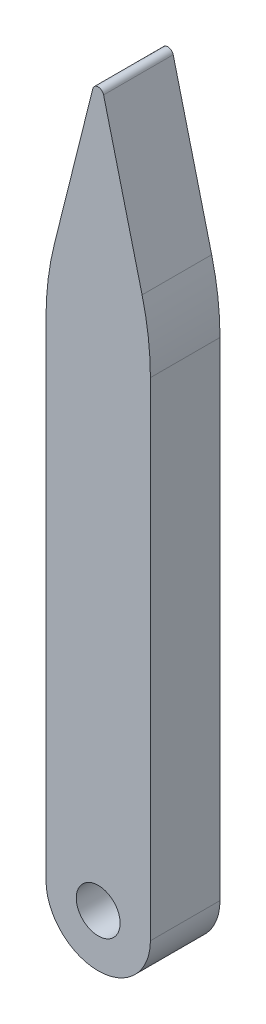
ISO-10303-21;
HEADER;
FILE_DESCRIPTION(('STEP AP214'),'2;1');
FILE_NAME('part.step','',(''),(''),'','','');
FILE_SCHEMA(('AUTOMOTIVE_DESIGN { 1 0 10303 214 1 1 1 1 }'));
ENDSEC;
DATA;
#1=APPLICATION_CONTEXT('core data for automotive mechanical design processes');
#2=APPLICATION_PROTOCOL_DEFINITION('international standard','automotive_design',2000,#1);
#3=PRODUCT_CONTEXT('',#1,'mechanical');
#4=PRODUCT('Part','Part','',(#3));
#5=PRODUCT_RELATED_PRODUCT_CATEGORY('part','',(#4));
#6=PRODUCT_DEFINITION_FORMATION('','',#4);
#7=PRODUCT_DEFINITION_CONTEXT('part definition',#1,'design');
#8=PRODUCT_DEFINITION('design','',#6,#7);
#9=PRODUCT_DEFINITION_SHAPE('','',#8);
#10=(LENGTH_UNIT() NAMED_UNIT(*) SI_UNIT(.MILLI.,.METRE.));
#11=(NAMED_UNIT(*) PLANE_ANGLE_UNIT() SI_UNIT($,.RADIAN.));
#12=(NAMED_UNIT(*) SI_UNIT($,.STERADIAN.) SOLID_ANGLE_UNIT());
#13=UNCERTAINTY_MEASURE_WITH_UNIT(LENGTH_MEASURE(1.E-05),#10,'distance_accuracy_value','');
#14=(GEOMETRIC_REPRESENTATION_CONTEXT(3) GLOBAL_UNCERTAINTY_ASSIGNED_CONTEXT((#13)) GLOBAL_UNIT_ASSIGNED_CONTEXT((#10,
#11,#12)) REPRESENTATION_CONTEXT('',''));
#15=CARTESIAN_POINT('',(0.,0.,0.));
#16=DIRECTION('',(0.,0.,1.));
#17=DIRECTION('',(1.,0.,0.));
#18=AXIS2_PLACEMENT_3D('',#15,#16,#17);
#19=CARTESIAN_POINT('',(0.,-6.,-1.5875));
#20=DIRECTION('',(0.,0.,1.));
#21=DIRECTION('',(1.,0.,0.));
#22=AXIS2_PLACEMENT_3D('',#19,#20,#21);
#23=CYLINDRICAL_SURFACE('',#22,1.190625);
#24=CARTESIAN_POINT('',(0.,-6.,0.));
#25=DIRECTION('',(0.,0.,1.));
#26=DIRECTION('',(1.,0.,0.));
#27=AXIS2_PLACEMENT_3D('',#24,#25,#26);
#28=CIRCLE('',#27,1.190625);
#29=CARTESIAN_POINT('',(-1.190625,-6.,0.));
#30=VERTEX_POINT('',#29);
#31=CARTESIAN_POINT('',(1.190625,-6.,0.));
#32=VERTEX_POINT('',#31);
#33=EDGE_CURVE('E135',#30,#32,#28,.T.);
#34=ORIENTED_EDGE('',*,*,#33,.F.);
#35=DIRECTION('',(0.,0.,1.));
#36=VECTOR('',#35,1.);
#37=CARTESIAN_POINT('',(-1.190625,-6.,-1.5875));
#38=LINE('',#37,#36);
#39=CARTESIAN_POINT('',(-1.190625,-6.,-1.5875));
#40=VERTEX_POINT('',#39);
#41=EDGE_CURVE('E107',#40,#30,#38,.T.);
#42=ORIENTED_EDGE('',*,*,#41,.F.);
#43=CARTESIAN_POINT('',(0.,-6.,-1.5875));
#44=DIRECTION('',(0.,0.,1.));
#45=DIRECTION('',(1.,0.,0.));
#46=AXIS2_PLACEMENT_3D('',#43,#44,#45);
#47=CIRCLE('',#46,1.190625);
#48=CARTESIAN_POINT('',(1.190625,-6.,-1.5875));
#49=VERTEX_POINT('',#48);
#50=EDGE_CURVE('E114',#40,#49,#47,.T.);
#51=ORIENTED_EDGE('',*,*,#50,.T.);
#52=DIRECTION('',(0.,0.,1.));
#53=VECTOR('',#52,1.);
#54=CARTESIAN_POINT('',(1.190625,-6.,-1.5875));
#55=LINE('',#54,#53);
#56=EDGE_CURVE('E95',#49,#32,#55,.T.);
#57=ORIENTED_EDGE('',*,*,#56,.T.);
#58=EDGE_LOOP('',(#34,#42,#51,#57));
#59=FACE_BOUND('',#58,.T.);
#60=ADVANCED_FACE('F32',(#59),#23,.T.);
#61=CARTESIAN_POINT('',(-1.190625,-6.,-1.5875));
#62=DIRECTION('',(-1.,0.,0.));
#63=DIRECTION('',(0.,0.,1.));
#64=AXIS2_PLACEMENT_3D('',#61,#62,#63);
#65=PLANE('',#64);
#66=DIRECTION('',(0.,-1.,0.));
#67=VECTOR('',#66,1.);
#68=CARTESIAN_POINT('',(-1.190625,-6.,0.));
#69=LINE('',#68,#67);
#70=CARTESIAN_POINT('',(-1.190625,5.12452927732785,0.));
#71=VERTEX_POINT('',#70);
#72=EDGE_CURVE('E122',#71,#30,#69,.T.);
#73=ORIENTED_EDGE('',*,*,#72,.F.);
#74=DIRECTION('',(0.,0.,1.));
#75=VECTOR('',#74,1.);
#76=CARTESIAN_POINT('',(-1.190625,5.12452927732785,-1.5875));
#77=LINE('',#76,#75);
#78=CARTESIAN_POINT('',(-1.190625,5.12452927732785,-1.5875));
#79=VERTEX_POINT('',#78);
#80=EDGE_CURVE('E158',#71,#79,#77,.F.);
#81=ORIENTED_EDGE('',*,*,#80,.T.);
#82=DIRECTION('',(0.,-1.,0.));
#83=VECTOR('',#82,1.);
#84=CARTESIAN_POINT('',(-1.190625,-6.,-1.5875));
#85=LINE('',#84,#83);
#86=EDGE_CURVE('E108',#79,#40,#85,.T.);
#87=ORIENTED_EDGE('',*,*,#86,.T.);
#88=ORIENTED_EDGE('',*,*,#41,.T.);
#89=EDGE_LOOP('',(#73,#81,#87,#88));
#90=FACE_BOUND('',#89,.T.);
#91=ADVANCED_FACE('F180',(#90),#65,.T.);
#92=CARTESIAN_POINT('',(-1.190625,5.90625,-1.5875));
#93=DIRECTION('',(-0.970142500145332,0.242535625036333,0.));
#94=DIRECTION('',(-0.242535625036333,-0.970142500145332,0.));
#95=AXIS2_PLACEMENT_3D('',#92,#93,#94);
#96=PLANE('',#95);
#97=DIRECTION('',(-0.242535625036333,-0.970142500145332,0.));
#98=VECTOR('',#97,1.);
#99=CARTESIAN_POINT('',(-1.190625,5.90625,0.));
#100=LINE('',#99,#98);
#101=CARTESIAN_POINT('',(-0.123208097518458,10.1759176099262,0.));
#102=VERTEX_POINT('',#101);
#103=CARTESIAN_POINT('',(-1.00102987592286,6.66463049630857,0.));
#104=VERTEX_POINT('',#103);
#105=EDGE_CURVE('E124',#102,#104,#100,.T.);
#106=ORIENTED_EDGE('',*,*,#105,.F.);
#107=DIRECTION('',(0.,0.,1.));
#108=VECTOR('',#107,1.);
#109=CARTESIAN_POINT('',(-0.123208097518458,10.1759176099262,-1.5875));
#110=LINE('',#109,#108);
#111=CARTESIAN_POINT('',(-0.123208097518458,10.1759176099262,-1.5875));
#112=VERTEX_POINT('',#111);
#113=EDGE_CURVE('E40',#102,#112,#110,.F.);
#114=ORIENTED_EDGE('',*,*,#113,.T.);
#115=DIRECTION('',(-0.242535625036333,-0.970142500145332,0.));
#116=VECTOR('',#115,1.);
#117=CARTESIAN_POINT('',(-1.190625,5.90625,-1.5875));
#118=LINE('',#117,#116);
#119=CARTESIAN_POINT('',(-1.00102987592286,6.66463049630857,-1.5875));
#120=VERTEX_POINT('',#119);
#121=EDGE_CURVE('E132',#112,#120,#118,.T.);
#122=ORIENTED_EDGE('',*,*,#121,.T.);
#123=DIRECTION('',(0.,0.,1.));
#124=VECTOR('',#123,1.);
#125=CARTESIAN_POINT('',(-1.00102987592286,6.66463049630857,-1.5875));
#126=LINE('',#125,#124);
#127=EDGE_CURVE('E155',#120,#104,#126,.T.);
#128=ORIENTED_EDGE('',*,*,#127,.T.);
#129=EDGE_LOOP('',(#106,#114,#122,#128));
#130=FACE_BOUND('',#129,.T.);
#131=ADVANCED_FACE('F185',(#130),#96,.T.);
#132=CARTESIAN_POINT('',(1.190625,5.90625,-1.5875));
#133=DIRECTION('',(0.970142500145332,0.242535625036333,0.));
#134=DIRECTION('',(-0.242535625036333,0.970142500145332,0.));
#135=AXIS2_PLACEMENT_3D('',#132,#133,#134);
#136=PLANE('',#135);
#137=DIRECTION('',(-0.242535625036333,0.970142500145332,0.));
#138=VECTOR('',#137,1.);
#139=CARTESIAN_POINT('',(1.190625,5.90625,-1.5875));
#140=LINE('',#139,#138);
#141=CARTESIAN_POINT('',(1.00102987592286,6.66463049630856,-1.5875));
#142=VERTEX_POINT('',#141);
#143=CARTESIAN_POINT('',(0.123208097518456,10.1759176099262,-1.5875));
#144=VERTEX_POINT('',#143);
#145=EDGE_CURVE('E118',#142,#144,#140,.T.);
#146=ORIENTED_EDGE('',*,*,#145,.T.);
#147=DIRECTION('',(0.,0.,1.));
#148=VECTOR('',#147,1.);
#149=CARTESIAN_POINT('',(0.123208097518456,10.1759176099262,-1.5875));
#150=LINE('',#149,#148);
#151=CARTESIAN_POINT('',(0.123208097518456,10.1759176099262,0.));
#152=VERTEX_POINT('',#151);
#153=EDGE_CURVE('E160',#144,#152,#150,.T.);
#154=ORIENTED_EDGE('',*,*,#153,.T.);
#155=DIRECTION('',(-0.242535625036333,0.970142500145332,0.));
#156=VECTOR('',#155,1.);
#157=CARTESIAN_POINT('',(1.190625,5.90625,0.));
#158=LINE('',#157,#156);
#159=CARTESIAN_POINT('',(1.00102987592286,6.66463049630856,0.));
#160=VERTEX_POINT('',#159);
#161=EDGE_CURVE('E139',#160,#152,#158,.T.);
#162=ORIENTED_EDGE('',*,*,#161,.F.);
#163=DIRECTION('',(0.,0.,1.));
#164=VECTOR('',#163,1.);
#165=CARTESIAN_POINT('',(1.00102987592286,6.66463049630856,-1.5875));
#166=LINE('',#165,#164);
#167=EDGE_CURVE('E149',#160,#142,#166,.F.);
#168=ORIENTED_EDGE('',*,*,#167,.T.);
#169=EDGE_LOOP('',(#146,#154,#162,#168));
#170=FACE_BOUND('',#169,.T.);
#171=ADVANCED_FACE('F166',(#170),#136,.T.);
#172=CARTESIAN_POINT('',(1.190625,-6.,-1.5875));
#173=DIRECTION('',(1.,0.,0.));
#174=DIRECTION('',(0.,1.,0.));
#175=AXIS2_PLACEMENT_3D('',#172,#173,#174);
#176=PLANE('',#175);
#177=DIRECTION('',(0.,1.,0.));
#178=VECTOR('',#177,1.);
#179=CARTESIAN_POINT('',(1.190625,-6.,-1.5875));
#180=LINE('',#179,#178);
#181=CARTESIAN_POINT('',(1.190625,5.12452927732785,-1.5875));
#182=VERTEX_POINT('',#181);
#183=EDGE_CURVE('E99',#49,#182,#180,.T.);
#184=ORIENTED_EDGE('',*,*,#183,.T.);
#185=DIRECTION('',(0.,0.,1.));
#186=VECTOR('',#185,1.);
#187=CARTESIAN_POINT('',(1.190625,5.12452927732785,-1.5875));
#188=LINE('',#187,#186);
#189=CARTESIAN_POINT('',(1.190625,5.12452927732785,0.));
#190=VERTEX_POINT('',#189);
#191=EDGE_CURVE('E142',#182,#190,#188,.T.);
#192=ORIENTED_EDGE('',*,*,#191,.T.);
#193=DIRECTION('',(0.,1.,0.));
#194=VECTOR('',#193,1.);
#195=CARTESIAN_POINT('',(1.190625,-6.,0.));
#196=LINE('',#195,#194);
#197=EDGE_CURVE('E102',#32,#190,#196,.T.);
#198=ORIENTED_EDGE('',*,*,#197,.F.);
#199=ORIENTED_EDGE('',*,*,#56,.F.);
#200=EDGE_LOOP('',(#184,#192,#198,#199));
#201=FACE_BOUND('',#200,.T.);
#202=ADVANCED_FACE('F97',(#201),#176,.T.);
#203=CARTESIAN_POINT('',(0.,-6.,-1.5875));
#204=DIRECTION('',(0.,0.,1.));
#205=DIRECTION('',(1.,0.,0.));
#206=AXIS2_PLACEMENT_3D('',#203,#204,#205);
#207=PLANE('',#206);
#208=CARTESIAN_POINT('',(0.,-6.,-1.5875));
#209=DIRECTION('',(0.,0.,1.));
#210=DIRECTION('',(1.,0.,0.));
#211=AXIS2_PLACEMENT_3D('',#208,#209,#210);
#212=CIRCLE('',#211,0.500000000000001);
#213=CARTESIAN_POINT('',(0.500000000000001,-6.,-1.5875));
#214=VERTEX_POINT('',#213);
#215=EDGE_CURVE('E137',#214,#214,#212,.T.);
#216=ORIENTED_EDGE('',*,*,#215,.T.);
#217=EDGE_LOOP('',(#216));
#218=FACE_BOUND('',#217,.T.);
#219=ORIENTED_EDGE('',*,*,#121,.F.);
#220=CARTESIAN_POINT('',(0.,10.1451155855466,-1.5875));
#221=DIRECTION('',(0.,0.,1.));
#222=DIRECTION('',(1.,0.,0.));
#223=AXIS2_PLACEMENT_3D('',#220,#221,#222);
#224=CIRCLE('',#223,0.127);
#225=EDGE_CURVE('E11',#112,#144,#224,.F.);
#226=ORIENTED_EDGE('',*,*,#225,.T.);
#227=ORIENTED_EDGE('',*,*,#145,.F.);
#228=CARTESIAN_POINT('',(-5.159375,5.12452927732785,-1.5875));
#229=DIRECTION('',(0.,0.,1.));
#230=DIRECTION('',(1.,0.,0.));
#231=AXIS2_PLACEMENT_3D('',#228,#229,#230);
#232=CIRCLE('',#231,6.35);
#233=EDGE_CURVE('E117',#142,#182,#232,.F.);
#234=ORIENTED_EDGE('',*,*,#233,.T.);
#235=ORIENTED_EDGE('',*,*,#183,.F.);
#236=ORIENTED_EDGE('',*,*,#50,.F.);
#237=ORIENTED_EDGE('',*,*,#86,.F.);
#238=CARTESIAN_POINT('',(5.159375,5.12452927732785,-1.5875));
#239=DIRECTION('',(0.,0.,1.));
#240=DIRECTION('',(1.,0.,0.));
#241=AXIS2_PLACEMENT_3D('',#238,#239,#240);
#242=CIRCLE('',#241,6.35);
#243=EDGE_CURVE('E151',#79,#120,#242,.F.);
#244=ORIENTED_EDGE('',*,*,#243,.T.);
#245=EDGE_LOOP('',(#219,#226,#227,#234,#235,#236,#237,#244));
#246=FACE_BOUND('',#245,.T.);
#247=ADVANCED_FACE('F112',(#218,#246),#207,.F.);
#248=CARTESIAN_POINT('',(0.,-6.,0.));
#249=DIRECTION('',(0.,0.,1.));
#250=DIRECTION('',(1.,0.,0.));
#251=AXIS2_PLACEMENT_3D('',#248,#249,#250);
#252=PLANE('',#251);
#253=CARTESIAN_POINT('',(0.,-6.,0.));
#254=DIRECTION('',(0.,0.,1.));
#255=DIRECTION('',(1.,0.,0.));
#256=AXIS2_PLACEMENT_3D('',#253,#254,#255);
#257=CIRCLE('',#256,0.500000000000001);
#258=CARTESIAN_POINT('',(0.500000000000001,-6.,0.));
#259=VERTEX_POINT('',#258);
#260=EDGE_CURVE('E127',#259,#259,#257,.T.);
#261=ORIENTED_EDGE('',*,*,#260,.F.);
#262=EDGE_LOOP('',(#261));
#263=FACE_BOUND('',#262,.T.);
#264=ORIENTED_EDGE('',*,*,#161,.T.);
#265=CARTESIAN_POINT('',(0.,10.1451155855466,0.));
#266=DIRECTION('',(0.,0.,1.));
#267=DIRECTION('',(1.,0.,0.));
#268=AXIS2_PLACEMENT_3D('',#265,#266,#267);
#269=CIRCLE('',#268,0.127);
#270=EDGE_CURVE('E54',#152,#102,#269,.T.);
#271=ORIENTED_EDGE('',*,*,#270,.T.);
#272=ORIENTED_EDGE('',*,*,#105,.T.);
#273=CARTESIAN_POINT('',(5.159375,5.12452927732785,0.));
#274=DIRECTION('',(0.,0.,1.));
#275=DIRECTION('',(1.,0.,0.));
#276=AXIS2_PLACEMENT_3D('',#273,#274,#275);
#277=CIRCLE('',#276,6.35);
#278=EDGE_CURVE('E145',#104,#71,#277,.T.);
#279=ORIENTED_EDGE('',*,*,#278,.T.);
#280=ORIENTED_EDGE('',*,*,#72,.T.);
#281=ORIENTED_EDGE('',*,*,#33,.T.);
#282=ORIENTED_EDGE('',*,*,#197,.T.);
#283=CARTESIAN_POINT('',(-5.159375,5.12452927732785,0.));
#284=DIRECTION('',(0.,0.,1.));
#285=DIRECTION('',(1.,0.,0.));
#286=AXIS2_PLACEMENT_3D('',#283,#284,#285);
#287=CIRCLE('',#286,6.35);
#288=EDGE_CURVE('E147',#190,#160,#287,.T.);
#289=ORIENTED_EDGE('',*,*,#288,.T.);
#290=EDGE_LOOP('',(#264,#271,#272,#279,#280,#281,#282,#289));
#291=FACE_BOUND('',#290,.T.);
#292=ADVANCED_FACE('F170',(#263,#291),#252,.T.);
#293=CARTESIAN_POINT('',(0.,-6.,-1.5875));
#294=DIRECTION('',(0.,0.,1.));
#295=DIRECTION('',(1.,0.,0.));
#296=AXIS2_PLACEMENT_3D('',#293,#294,#295);
#297=CYLINDRICAL_SURFACE('',#296,0.500000000000001);
#298=ORIENTED_EDGE('',*,*,#215,.F.);
#299=EDGE_LOOP('',(#298));
#300=FACE_BOUND('',#299,.T.);
#301=ORIENTED_EDGE('',*,*,#260,.T.);
#302=EDGE_LOOP('',(#301));
#303=FACE_BOUND('',#302,.T.);
#304=ADVANCED_FACE('F192',(#300,#303),#297,.F.);
#305=CARTESIAN_POINT('',(-5.159375,5.12452927732785,-1.5875));
#306=DIRECTION('',(0.,0.,1.));
#307=DIRECTION('',(1.,0.,0.));
#308=AXIS2_PLACEMENT_3D('',#305,#306,#307);
#309=CYLINDRICAL_SURFACE('',#308,6.35);
#310=ORIENTED_EDGE('',*,*,#233,.F.);
#311=ORIENTED_EDGE('',*,*,#167,.F.);
#312=ORIENTED_EDGE('',*,*,#288,.F.);
#313=ORIENTED_EDGE('',*,*,#191,.F.);
#314=EDGE_LOOP('',(#310,#311,#312,#313));
#315=FACE_BOUND('',#314,.T.);
#316=ADVANCED_FACE('F172',(#315),#309,.T.);
#317=CARTESIAN_POINT('',(5.159375,5.12452927732785,-1.5875));
#318=DIRECTION('',(0.,0.,1.));
#319=DIRECTION('',(1.,0.,0.));
#320=AXIS2_PLACEMENT_3D('',#317,#318,#319);
#321=CYLINDRICAL_SURFACE('',#320,6.35);
#322=ORIENTED_EDGE('',*,*,#243,.F.);
#323=ORIENTED_EDGE('',*,*,#80,.F.);
#324=ORIENTED_EDGE('',*,*,#278,.F.);
#325=ORIENTED_EDGE('',*,*,#127,.F.);
#326=EDGE_LOOP('',(#322,#323,#324,#325));
#327=FACE_BOUND('',#326,.T.);
#328=ADVANCED_FACE('F174',(#327),#321,.T.);
#329=CARTESIAN_POINT('',(0.,10.1451155855466,-1.5875));
#330=DIRECTION('',(0.,0.,1.));
#331=DIRECTION('',(1.,0.,0.));
#332=AXIS2_PLACEMENT_3D('',#329,#330,#331);
#333=CYLINDRICAL_SURFACE('',#332,0.127);
#334=ORIENTED_EDGE('',*,*,#225,.F.);
#335=ORIENTED_EDGE('',*,*,#113,.F.);
#336=ORIENTED_EDGE('',*,*,#270,.F.);
#337=ORIENTED_EDGE('',*,*,#153,.F.);
#338=EDGE_LOOP('',(#334,#335,#336,#337));
#339=FACE_BOUND('',#338,.T.);
#340=ADVANCED_FACE('F34',(#339),#333,.T.);
#341=CLOSED_SHELL('',(#60,#91,#131,#171,#202,#247,#292,#304,#316,#328,#340));
#342=MANIFOLD_SOLID_BREP('B2',#341);
#343=ADVANCED_BREP_SHAPE_REPRESENTATION('',(#18,#342),#14);
#344=SHAPE_DEFINITION_REPRESENTATION(#9,#343);
ENDSEC;
END-ISO-10303-21;
